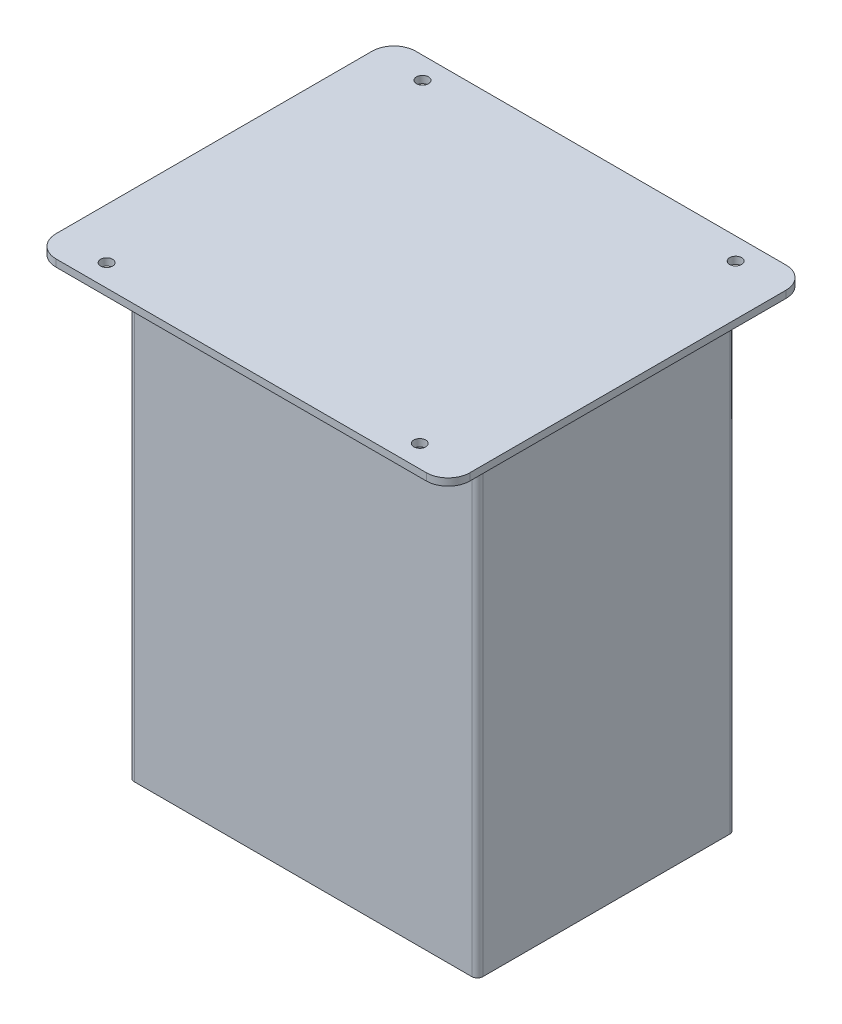
ISO-10303-21;
HEADER;
FILE_DESCRIPTION(('STEP AP214'),'2;1');
FILE_NAME('part.step','',(''),(''),'','','');
FILE_SCHEMA(('AUTOMOTIVE_DESIGN { 1 0 10303 214 1 1 1 1 }'));
ENDSEC;
DATA;
#1=APPLICATION_CONTEXT('core data for automotive mechanical design processes');
#2=APPLICATION_PROTOCOL_DEFINITION('international standard','automotive_design',2000,#1);
#3=PRODUCT_CONTEXT('',#1,'mechanical');
#4=PRODUCT('Part','Part','',(#3));
#5=PRODUCT_RELATED_PRODUCT_CATEGORY('part','',(#4));
#6=PRODUCT_DEFINITION_FORMATION('','',#4);
#7=PRODUCT_DEFINITION_CONTEXT('part definition',#1,'design');
#8=PRODUCT_DEFINITION('design','',#6,#7);
#9=PRODUCT_DEFINITION_SHAPE('','',#8);
#10=(LENGTH_UNIT() NAMED_UNIT(*) SI_UNIT(.MILLI.,.METRE.));
#11=(NAMED_UNIT(*) PLANE_ANGLE_UNIT() SI_UNIT($,.RADIAN.));
#12=(NAMED_UNIT(*) SI_UNIT($,.STERADIAN.) SOLID_ANGLE_UNIT());
#13=UNCERTAINTY_MEASURE_WITH_UNIT(LENGTH_MEASURE(1.E-05),#10,'distance_accuracy_value','');
#14=(GEOMETRIC_REPRESENTATION_CONTEXT(3) GLOBAL_UNCERTAINTY_ASSIGNED_CONTEXT((#13)) GLOBAL_UNIT_ASSIGNED_CONTEXT((#10,
#11,#12)) REPRESENTATION_CONTEXT('',''));
#15=CARTESIAN_POINT('',(0.,0.,0.));
#16=DIRECTION('',(0.,0.,1.));
#17=DIRECTION('',(1.,0.,0.));
#18=AXIS2_PLACEMENT_3D('',#15,#16,#17);
#19=CARTESIAN_POINT('',(94.9949,3.302,-82.55));
#20=DIRECTION('',(-1.,0.,0.));
#21=DIRECTION('',(0.,0.,-1.));
#22=AXIS2_PLACEMENT_3D('',#19,#20,#21);
#23=PLANE('',#22);
#24=DIRECTION('',(0.,0.,1.));
#25=VECTOR('',#24,1.);
#26=CARTESIAN_POINT('',(94.9949,0.,-82.55));
#27=LINE('',#26,#25);
#28=CARTESIAN_POINT('',(94.9949,0.,-72.55));
#29=VERTEX_POINT('',#28);
#30=CARTESIAN_POINT('',(94.9949,0.,72.55));
#31=VERTEX_POINT('',#30);
#32=EDGE_CURVE('E315',#29,#31,#27,.T.);
#33=ORIENTED_EDGE('',*,*,#32,.F.);
#34=DIRECTION('',(0.,-1.,0.));
#35=VECTOR('',#34,1.);
#36=CARTESIAN_POINT('',(94.9949,3.302,-72.55));
#37=LINE('',#36,#35);
#38=CARTESIAN_POINT('',(94.9949,3.302,-72.55));
#39=VERTEX_POINT('',#38);
#40=EDGE_CURVE('E367',#39,#29,#37,.T.);
#41=ORIENTED_EDGE('',*,*,#40,.F.);
#42=DIRECTION('',(0.,0.,1.));
#43=VECTOR('',#42,1.);
#44=CARTESIAN_POINT('',(94.9949,3.302,-82.55));
#45=LINE('',#44,#43);
#46=CARTESIAN_POINT('',(94.9949,3.302,72.55));
#47=VERTEX_POINT('',#46);
#48=EDGE_CURVE('E316',#39,#47,#45,.T.);
#49=ORIENTED_EDGE('',*,*,#48,.T.);
#50=DIRECTION('',(0.,-1.,0.));
#51=VECTOR('',#50,1.);
#52=CARTESIAN_POINT('',(94.9949,3.302,72.55));
#53=LINE('',#52,#51);
#54=EDGE_CURVE('E370',#31,#47,#53,.F.);
#55=ORIENTED_EDGE('',*,*,#54,.F.);
#56=EDGE_LOOP('',(#33,#41,#49,#55));
#57=FACE_BOUND('',#56,.T.);
#58=ADVANCED_FACE('F39',(#57),#23,.F.);
#59=CARTESIAN_POINT('',(-94.9949,3.302,82.55));
#60=DIRECTION('',(0.,0.,-1.));
#61=DIRECTION('',(1.,0.,0.));
#62=AXIS2_PLACEMENT_3D('',#59,#60,#61);
#63=PLANE('',#62);
#64=DIRECTION('',(-1.,0.,0.));
#65=VECTOR('',#64,1.);
#66=CARTESIAN_POINT('',(-94.9949,0.,82.55));
#67=LINE('',#66,#65);
#68=CARTESIAN_POINT('',(84.9949,0.,82.55));
#69=VERTEX_POINT('',#68);
#70=CARTESIAN_POINT('',(-84.9949,0.,82.55));
#71=VERTEX_POINT('',#70);
#72=EDGE_CURVE('E332',#69,#71,#67,.T.);
#73=ORIENTED_EDGE('',*,*,#72,.F.);
#74=DIRECTION('',(0.,-1.,0.));
#75=VECTOR('',#74,1.);
#76=CARTESIAN_POINT('',(84.9949000000001,3.302,82.55));
#77=LINE('',#76,#75);
#78=CARTESIAN_POINT('',(84.9949,3.302,82.55));
#79=VERTEX_POINT('',#78);
#80=EDGE_CURVE('E353',#79,#69,#77,.T.);
#81=ORIENTED_EDGE('',*,*,#80,.F.);
#82=DIRECTION('',(-1.,0.,0.));
#83=VECTOR('',#82,1.);
#84=CARTESIAN_POINT('',(-94.9949,3.302,82.55));
#85=LINE('',#84,#83);
#86=CARTESIAN_POINT('',(-84.9949,3.302,82.55));
#87=VERTEX_POINT('',#86);
#88=EDGE_CURVE('E319',#79,#87,#85,.T.);
#89=ORIENTED_EDGE('',*,*,#88,.T.);
#90=DIRECTION('',(0.,-1.,0.));
#91=VECTOR('',#90,1.);
#92=CARTESIAN_POINT('',(-84.9949,3.302,82.55));
#93=LINE('',#92,#91);
#94=EDGE_CURVE('E356',#71,#87,#93,.F.);
#95=ORIENTED_EDGE('',*,*,#94,.F.);
#96=EDGE_LOOP('',(#73,#81,#89,#95));
#97=FACE_BOUND('',#96,.T.);
#98=ADVANCED_FACE('F472',(#97),#63,.F.);
#99=CARTESIAN_POINT('',(-94.9949,3.302,-82.55));
#100=DIRECTION('',(1.,0.,0.));
#101=DIRECTION('',(0.,0.,1.));
#102=AXIS2_PLACEMENT_3D('',#99,#100,#101);
#103=PLANE('',#102);
#104=DIRECTION('',(0.,0.,-1.));
#105=VECTOR('',#104,1.);
#106=CARTESIAN_POINT('',(-94.9949,3.302,-82.55));
#107=LINE('',#106,#105);
#108=CARTESIAN_POINT('',(-94.9949,3.302,72.55));
#109=VERTEX_POINT('',#108);
#110=CARTESIAN_POINT('',(-94.9949,3.302,-72.55));
#111=VERTEX_POINT('',#110);
#112=EDGE_CURVE('E323',#109,#111,#107,.T.);
#113=ORIENTED_EDGE('',*,*,#112,.T.);
#114=DIRECTION('',(0.,-1.,0.));
#115=VECTOR('',#114,1.);
#116=CARTESIAN_POINT('',(-94.9949,3.302,-72.55));
#117=LINE('',#116,#115);
#118=CARTESIAN_POINT('',(-94.9949,0.,-72.55));
#119=VERTEX_POINT('',#118);
#120=EDGE_CURVE('E329',#119,#111,#117,.F.);
#121=ORIENTED_EDGE('',*,*,#120,.F.);
#122=DIRECTION('',(0.,0.,-1.));
#123=VECTOR('',#122,1.);
#124=CARTESIAN_POINT('',(-94.9949,0.,-82.55));
#125=LINE('',#124,#123);
#126=CARTESIAN_POINT('',(-94.9949,0.,72.55));
#127=VERTEX_POINT('',#126);
#128=EDGE_CURVE('E335',#127,#119,#125,.T.);
#129=ORIENTED_EDGE('',*,*,#128,.F.);
#130=DIRECTION('',(0.,-1.,0.));
#131=VECTOR('',#130,1.);
#132=CARTESIAN_POINT('',(-94.9949,3.302,72.55));
#133=LINE('',#132,#131);
#134=EDGE_CURVE('E342',#109,#127,#133,.T.);
#135=ORIENTED_EDGE('',*,*,#134,.F.);
#136=EDGE_LOOP('',(#113,#121,#129,#135));
#137=FACE_BOUND('',#136,.T.);
#138=ADVANCED_FACE('F478',(#137),#103,.F.);
#139=CARTESIAN_POINT('',(-94.9949,3.302,-82.55));
#140=DIRECTION('',(0.,0.,1.));
#141=DIRECTION('',(-1.,0.,0.));
#142=AXIS2_PLACEMENT_3D('',#139,#140,#141);
#143=PLANE('',#142);
#144=DIRECTION('',(1.,0.,0.));
#145=VECTOR('',#144,1.);
#146=CARTESIAN_POINT('',(-94.9949,0.,-82.55));
#147=LINE('',#146,#145);
#148=CARTESIAN_POINT('',(-84.9949,0.,-82.55));
#149=VERTEX_POINT('',#148);
#150=CARTESIAN_POINT('',(84.9949,0.,-82.55));
#151=VERTEX_POINT('',#150);
#152=EDGE_CURVE('E320',#149,#151,#147,.T.);
#153=ORIENTED_EDGE('',*,*,#152,.F.);
#154=DIRECTION('',(0.,-1.,0.));
#155=VECTOR('',#154,1.);
#156=CARTESIAN_POINT('',(-84.9949,3.302,-82.55));
#157=LINE('',#156,#155);
#158=CARTESIAN_POINT('',(-84.9949,3.302,-82.55));
#159=VERTEX_POINT('',#158);
#160=EDGE_CURVE('E373',#159,#149,#157,.T.);
#161=ORIENTED_EDGE('',*,*,#160,.F.);
#162=DIRECTION('',(1.,0.,0.));
#163=VECTOR('',#162,1.);
#164=CARTESIAN_POINT('',(-94.9949,3.302,-82.55));
#165=LINE('',#164,#163);
#166=CARTESIAN_POINT('',(84.9949,3.302,-82.55));
#167=VERTEX_POINT('',#166);
#168=EDGE_CURVE('E326',#159,#167,#165,.T.);
#169=ORIENTED_EDGE('',*,*,#168,.T.);
#170=DIRECTION('',(0.,-1.,0.));
#171=VECTOR('',#170,1.);
#172=CARTESIAN_POINT('',(84.9949000000001,3.302,-82.55));
#173=LINE('',#172,#171);
#174=EDGE_CURVE('E376',#151,#167,#173,.F.);
#175=ORIENTED_EDGE('',*,*,#174,.F.);
#176=EDGE_LOOP('',(#153,#161,#169,#175));
#177=FACE_BOUND('',#176,.T.);
#178=ADVANCED_FACE('F827',(#177),#143,.F.);
#179=CARTESIAN_POINT('',(0.,3.302,0.));
#180=DIRECTION('',(0.,-1.,0.));
#181=DIRECTION('',(0.,0.,1.));
#182=AXIS2_PLACEMENT_3D('',#179,#180,#181);
#183=PLANE('',#182);
#184=CARTESIAN_POINT('',(71.8681572309746,3.302,-72.5500000000002));
#185=DIRECTION('',(0.,-1.,0.));
#186=DIRECTION('',(0.,0.,-1.));
#187=AXIS2_PLACEMENT_3D('',#184,#185,#186);
#188=CIRCLE('',#187,2.74999999999999);
#189=CARTESIAN_POINT('',(71.8681572309746,3.302,-75.3000000000002));
#190=VERTEX_POINT('',#189);
#191=EDGE_CURVE('E291',#190,#190,#188,.T.);
#192=ORIENTED_EDGE('',*,*,#191,.T.);
#193=EDGE_LOOP('',(#192));
#194=FACE_BOUND('',#193,.T.);
#195=CARTESIAN_POINT('',(-71.8681572309744,3.302,-72.5500000000002));
#196=DIRECTION('',(0.,-1.,0.));
#197=DIRECTION('',(0.,0.,-1.));
#198=AXIS2_PLACEMENT_3D('',#195,#196,#197);
#199=CIRCLE('',#198,2.74999999999999);
#200=CARTESIAN_POINT('',(-71.8681572309744,3.302,-75.3000000000001));
#201=VERTEX_POINT('',#200);
#202=EDGE_CURVE('E297',#201,#201,#199,.T.);
#203=ORIENTED_EDGE('',*,*,#202,.T.);
#204=EDGE_LOOP('',(#203));
#205=FACE_BOUND('',#204,.T.);
#206=CARTESIAN_POINT('',(71.8681572309747,3.302,72.4296));
#207=DIRECTION('',(0.,-1.,0.));
#208=DIRECTION('',(0.,0.,-1.));
#209=AXIS2_PLACEMENT_3D('',#206,#207,#208);
#210=CIRCLE('',#209,2.74999999999999);
#211=CARTESIAN_POINT('',(71.8681572309747,3.302,69.6796));
#212=VERTEX_POINT('',#211);
#213=EDGE_CURVE('E303',#212,#212,#210,.T.);
#214=ORIENTED_EDGE('',*,*,#213,.T.);
#215=EDGE_LOOP('',(#214));
#216=FACE_BOUND('',#215,.T.);
#217=CARTESIAN_POINT('',(-71.8681572309743,3.302,72.4296000000001));
#218=DIRECTION('',(0.,-1.,0.));
#219=DIRECTION('',(0.,0.,-1.));
#220=AXIS2_PLACEMENT_3D('',#217,#218,#219);
#221=CIRCLE('',#220,2.74999999999999);
#222=CARTESIAN_POINT('',(-71.8681572309743,3.302,69.6796000000001));
#223=VERTEX_POINT('',#222);
#224=EDGE_CURVE('E309',#223,#223,#221,.T.);
#225=ORIENTED_EDGE('',*,*,#224,.T.);
#226=EDGE_LOOP('',(#225));
#227=FACE_BOUND('',#226,.T.);
#228=ORIENTED_EDGE('',*,*,#88,.F.);
#229=CARTESIAN_POINT('',(84.9949000000001,3.302,72.55));
#230=DIRECTION('',(0.,1.,0.));
#231=DIRECTION('',(0.,0.,1.));
#232=AXIS2_PLACEMENT_3D('',#229,#230,#231);
#233=CIRCLE('',#232,10.);
#234=EDGE_CURVE('E363',#47,#79,#233,.F.);
#235=ORIENTED_EDGE('',*,*,#234,.F.);
#236=ORIENTED_EDGE('',*,*,#48,.F.);
#237=CARTESIAN_POINT('',(84.9949,3.302,-72.55));
#238=DIRECTION('',(0.,1.,0.));
#239=DIRECTION('',(0.,0.,1.));
#240=AXIS2_PLACEMENT_3D('',#237,#238,#239);
#241=CIRCLE('',#240,10.);
#242=EDGE_CURVE('E361',#167,#39,#241,.F.);
#243=ORIENTED_EDGE('',*,*,#242,.F.);
#244=ORIENTED_EDGE('',*,*,#168,.F.);
#245=CARTESIAN_POINT('',(-84.9949,3.302,-72.55));
#246=DIRECTION('',(0.,1.,0.));
#247=DIRECTION('',(0.,0.,1.));
#248=AXIS2_PLACEMENT_3D('',#245,#246,#247);
#249=CIRCLE('',#248,10.);
#250=EDGE_CURVE('E359',#111,#159,#249,.F.);
#251=ORIENTED_EDGE('',*,*,#250,.F.);
#252=ORIENTED_EDGE('',*,*,#112,.F.);
#253=CARTESIAN_POINT('',(-84.9949,3.302,72.55));
#254=DIRECTION('',(0.,1.,0.));
#255=DIRECTION('',(0.,0.,1.));
#256=AXIS2_PLACEMENT_3D('',#253,#254,#255);
#257=CIRCLE('',#256,10.);
#258=EDGE_CURVE('E365',#87,#109,#257,.F.);
#259=ORIENTED_EDGE('',*,*,#258,.F.);
#260=EDGE_LOOP('',(#228,#235,#236,#243,#244,#251,#252,#259));
#261=FACE_BOUND('',#260,.T.);
#262=ADVANCED_FACE('F817',(#194,#205,#216,#227,#261),#183,.F.);
#263=CARTESIAN_POINT('',(0.,0.,0.));
#264=DIRECTION('',(0.,-1.,0.));
#265=DIRECTION('',(0.,0.,1.));
#266=AXIS2_PLACEMENT_3D('',#263,#264,#265);
#267=PLANE('',#266);
#268=DIRECTION('',(0.,0.,1.));
#269=VECTOR('',#268,1.);
#270=CARTESIAN_POINT('',(85.0051000000002,0.,0.));
#271=LINE('',#270,#269);
#272=CARTESIAN_POINT('',(85.0051000000001,0.,-56.71));
#273=VERTEX_POINT('',#272);
#274=CARTESIAN_POINT('',(85.0051000000002,0.,56.5978));
#275=VERTEX_POINT('',#274);
#276=EDGE_CURVE('E281',#273,#275,#271,.T.);
#277=ORIENTED_EDGE('',*,*,#276,.F.);
#278=CARTESIAN_POINT('',(82.4651000000001,0.,-56.71));
#279=DIRECTION('',(0.,1.,0.));
#280=DIRECTION('',(0.,0.,1.));
#281=AXIS2_PLACEMENT_3D('',#278,#279,#280);
#282=CIRCLE('',#281,2.54);
#283=CARTESIAN_POINT('',(82.4651000000001,0.,-59.25));
#284=VERTEX_POINT('',#283);
#285=EDGE_CURVE('E427',#284,#273,#282,.F.);
#286=ORIENTED_EDGE('',*,*,#285,.F.);
#287=DIRECTION('',(-1.,0.,0.));
#288=VECTOR('',#287,1.);
#289=CARTESIAN_POINT('',(0.,0.,-59.25));
#290=LINE('',#289,#288);
#291=CARTESIAN_POINT('',(77.4609000000002,0.,-59.25));
#292=VERTEX_POINT('',#291);
#293=EDGE_CURVE('E258',#284,#292,#290,.T.);
#294=ORIENTED_EDGE('',*,*,#293,.T.);
#295=CARTESIAN_POINT('',(77.4609000000002,0.,-56.71));
#296=DIRECTION('',(0.,1.,0.));
#297=DIRECTION('',(0.,0.,1.));
#298=AXIS2_PLACEMENT_3D('',#295,#296,#297);
#299=CIRCLE('',#298,2.54);
#300=CARTESIAN_POINT('',(74.9209000000002,0.,-56.71));
#301=VERTEX_POINT('',#300);
#302=EDGE_CURVE('E47',#301,#292,#299,.F.);
#303=ORIENTED_EDGE('',*,*,#302,.F.);
#304=DIRECTION('',(0.,0.,-1.));
#305=VECTOR('',#304,1.);
#306=CARTESIAN_POINT('',(74.9209000000002,0.,0.));
#307=LINE('',#306,#305);
#308=CARTESIAN_POINT('',(74.9209000000002,0.,49.09));
#309=VERTEX_POINT('',#308);
#310=EDGE_CURVE('E253',#309,#301,#307,.T.);
#311=ORIENTED_EDGE('',*,*,#310,.F.);
#312=DIRECTION('',(1.,0.,0.));
#313=VECTOR('',#312,1.);
#314=CARTESIAN_POINT('',(0.,0.,49.09));
#315=LINE('',#314,#313);
#316=CARTESIAN_POINT('',(-64.8450999999998,0.,49.09));
#317=VERTEX_POINT('',#316);
#318=EDGE_CURVE('E273',#317,#309,#315,.T.);
#319=ORIENTED_EDGE('',*,*,#318,.F.);
#320=DIRECTION('',(0.,0.,1.));
#321=VECTOR('',#320,1.);
#322=CARTESIAN_POINT('',(-64.8450999999998,0.,0.));
#323=LINE('',#322,#321);
#324=CARTESIAN_POINT('',(-64.8450999999998,0.,-56.71));
#325=VERTEX_POINT('',#324);
#326=EDGE_CURVE('E276',#325,#317,#323,.T.);
#327=ORIENTED_EDGE('',*,*,#326,.F.);
#328=CARTESIAN_POINT('',(-67.3850999999999,0.,-56.71));
#329=DIRECTION('',(0.,1.,0.));
#330=DIRECTION('',(0.,0.,1.));
#331=AXIS2_PLACEMENT_3D('',#328,#329,#330);
#332=CIRCLE('',#331,2.54);
#333=CARTESIAN_POINT('',(-67.3850999999999,0.,-59.25));
#334=VERTEX_POINT('',#333);
#335=EDGE_CURVE('E11',#334,#325,#332,.F.);
#336=ORIENTED_EDGE('',*,*,#335,.F.);
#337=CARTESIAN_POINT('',(-72.4650999999998,0.,-59.25));
#338=VERTEX_POINT('',#337);
#339=EDGE_CURVE('E278',#334,#338,#290,.T.);
#340=ORIENTED_EDGE('',*,*,#339,.T.);
#341=CARTESIAN_POINT('',(-72.4650999999998,0.,-56.71));
#342=DIRECTION('',(0.,1.,0.));
#343=DIRECTION('',(0.,0.,1.));
#344=AXIS2_PLACEMENT_3D('',#341,#342,#343);
#345=CIRCLE('',#344,2.54);
#346=CARTESIAN_POINT('',(-75.0050999999998,0.,-56.71));
#347=VERTEX_POINT('',#346);
#348=EDGE_CURVE('E424',#347,#338,#345,.F.);
#349=ORIENTED_EDGE('',*,*,#348,.F.);
#350=DIRECTION('',(0.,0.,1.));
#351=VECTOR('',#350,1.);
#352=CARTESIAN_POINT('',(-75.0050999999998,0.,0.));
#353=LINE('',#352,#351);
#354=CARTESIAN_POINT('',(-75.0050999999998,0.,56.5978));
#355=VERTEX_POINT('',#354);
#356=EDGE_CURVE('E282',#347,#355,#353,.T.);
#357=ORIENTED_EDGE('',*,*,#356,.T.);
#358=CARTESIAN_POINT('',(-72.4650999999998,0.,56.5978));
#359=DIRECTION('',(0.,1.,0.));
#360=DIRECTION('',(0.,0.,1.));
#361=AXIS2_PLACEMENT_3D('',#358,#359,#360);
#362=CIRCLE('',#361,2.54);
#363=CARTESIAN_POINT('',(-72.4650999999998,0.,59.1378));
#364=VERTEX_POINT('',#363);
#365=EDGE_CURVE('E421',#364,#355,#362,.F.);
#366=ORIENTED_EDGE('',*,*,#365,.F.);
#367=DIRECTION('',(-1.,0.,0.));
#368=VECTOR('',#367,1.);
#369=CARTESIAN_POINT('',(85.0051000000001,0.,59.1378));
#370=LINE('',#369,#368);
#371=CARTESIAN_POINT('',(82.4651000000002,0.,59.1378));
#372=VERTEX_POINT('',#371);
#373=EDGE_CURVE('E223',#372,#364,#370,.T.);
#374=ORIENTED_EDGE('',*,*,#373,.F.);
#375=CARTESIAN_POINT('',(82.4651000000002,0.,56.5978));
#376=DIRECTION('',(0.,1.,0.));
#377=DIRECTION('',(0.,0.,1.));
#378=AXIS2_PLACEMENT_3D('',#375,#376,#377);
#379=CIRCLE('',#378,2.54);
#380=EDGE_CURVE('E418',#275,#372,#379,.F.);
#381=ORIENTED_EDGE('',*,*,#380,.F.);
#382=EDGE_LOOP('',(#277,#286,#294,#303,#311,#319,#327,#336,#340,#349,#357,#366,#374,#381));
#383=FACE_BOUND('',#382,.T.);
#384=CARTESIAN_POINT('',(71.8681572309746,0.,-72.5500000000002));
#385=DIRECTION('',(0.,1.,0.));
#386=DIRECTION('',(0.,0.,1.));
#387=AXIS2_PLACEMENT_3D('',#384,#385,#386);
#388=CIRCLE('',#387,2.75);
#389=CARTESIAN_POINT('',(71.8681572309746,0.,-69.8000000000002));
#390=VERTEX_POINT('',#389);
#391=EDGE_CURVE('E294',#390,#390,#388,.T.);
#392=ORIENTED_EDGE('',*,*,#391,.T.);
#393=EDGE_LOOP('',(#392));
#394=FACE_BOUND('',#393,.T.);
#395=CARTESIAN_POINT('',(-71.8681572309744,0.,-72.5500000000002));
#396=DIRECTION('',(0.,1.,0.));
#397=DIRECTION('',(0.,0.,1.));
#398=AXIS2_PLACEMENT_3D('',#395,#396,#397);
#399=CIRCLE('',#398,2.75);
#400=CARTESIAN_POINT('',(-71.8681572309744,0.,-69.8000000000002));
#401=VERTEX_POINT('',#400);
#402=EDGE_CURVE('E300',#401,#401,#399,.T.);
#403=ORIENTED_EDGE('',*,*,#402,.T.);
#404=EDGE_LOOP('',(#403));
#405=FACE_BOUND('',#404,.T.);
#406=CARTESIAN_POINT('',(71.8681572309747,0.,72.4296));
#407=DIRECTION('',(0.,1.,0.));
#408=DIRECTION('',(0.,0.,1.));
#409=AXIS2_PLACEMENT_3D('',#406,#407,#408);
#410=CIRCLE('',#409,2.75);
#411=CARTESIAN_POINT('',(71.8681572309747,0.,75.1796));
#412=VERTEX_POINT('',#411);
#413=EDGE_CURVE('E306',#412,#412,#410,.T.);
#414=ORIENTED_EDGE('',*,*,#413,.T.);
#415=EDGE_LOOP('',(#414));
#416=FACE_BOUND('',#415,.T.);
#417=CARTESIAN_POINT('',(-71.8681572309743,0.,72.4296000000001));
#418=DIRECTION('',(0.,1.,0.));
#419=DIRECTION('',(0.,0.,1.));
#420=AXIS2_PLACEMENT_3D('',#417,#418,#419);
#421=CIRCLE('',#420,2.75);
#422=CARTESIAN_POINT('',(-71.8681572309743,0.,75.1796));
#423=VERTEX_POINT('',#422);
#424=EDGE_CURVE('E312',#423,#423,#421,.T.);
#425=ORIENTED_EDGE('',*,*,#424,.T.);
#426=EDGE_LOOP('',(#425));
#427=FACE_BOUND('',#426,.T.);
#428=ORIENTED_EDGE('',*,*,#128,.T.);
#429=CARTESIAN_POINT('',(-84.9949,0.,-72.55));
#430=DIRECTION('',(0.,1.,0.));
#431=DIRECTION('',(0.,0.,1.));
#432=AXIS2_PLACEMENT_3D('',#429,#430,#431);
#433=CIRCLE('',#432,10.);
#434=EDGE_CURVE('E345',#149,#119,#433,.T.);
#435=ORIENTED_EDGE('',*,*,#434,.F.);
#436=ORIENTED_EDGE('',*,*,#152,.T.);
#437=CARTESIAN_POINT('',(84.9949,0.,-72.55));
#438=DIRECTION('',(0.,1.,0.));
#439=DIRECTION('',(0.,0.,1.));
#440=AXIS2_PLACEMENT_3D('',#437,#438,#439);
#441=CIRCLE('',#440,10.);
#442=EDGE_CURVE('E347',#29,#151,#441,.T.);
#443=ORIENTED_EDGE('',*,*,#442,.F.);
#444=ORIENTED_EDGE('',*,*,#32,.T.);
#445=CARTESIAN_POINT('',(84.9949000000001,0.,72.55));
#446=DIRECTION('',(0.,1.,0.));
#447=DIRECTION('',(0.,0.,1.));
#448=AXIS2_PLACEMENT_3D('',#445,#446,#447);
#449=CIRCLE('',#448,10.);
#450=EDGE_CURVE('E349',#69,#31,#449,.T.);
#451=ORIENTED_EDGE('',*,*,#450,.F.);
#452=ORIENTED_EDGE('',*,*,#72,.T.);
#453=CARTESIAN_POINT('',(-84.9949,0.,72.55));
#454=DIRECTION('',(0.,1.,0.));
#455=DIRECTION('',(0.,0.,1.));
#456=AXIS2_PLACEMENT_3D('',#453,#454,#455);
#457=CIRCLE('',#456,10.);
#458=EDGE_CURVE('E351',#127,#71,#457,.T.);
#459=ORIENTED_EDGE('',*,*,#458,.F.);
#460=EDGE_LOOP('',(#428,#435,#436,#443,#444,#451,#452,#459));
#461=FACE_BOUND('',#460,.T.);
#462=ADVANCED_FACE('F437',(#383,#394,#405,#416,#427,#461),#267,.T.);
#463=CARTESIAN_POINT('',(-71.8681572309743,3.302,72.4296000000001));
#464=DIRECTION('',(0.,1.,0.));
#465=DIRECTION('',(0.,0.,-1.));
#466=AXIS2_PLACEMENT_3D('',#463,#464,#465);
#467=CYLINDRICAL_SURFACE('',#466,2.75);
#468=ORIENTED_EDGE('',*,*,#224,.F.);
#469=EDGE_LOOP('',(#468));
#470=FACE_BOUND('',#469,.T.);
#471=ORIENTED_EDGE('',*,*,#424,.F.);
#472=EDGE_LOOP('',(#471));
#473=FACE_BOUND('',#472,.T.);
#474=ADVANCED_FACE('F798',(#470,#473),#467,.F.);
#475=CARTESIAN_POINT('',(71.8681572309747,3.302,72.4296));
#476=DIRECTION('',(0.,1.,0.));
#477=DIRECTION('',(0.,0.,-1.));
#478=AXIS2_PLACEMENT_3D('',#475,#476,#477);
#479=CYLINDRICAL_SURFACE('',#478,2.75);
#480=ORIENTED_EDGE('',*,*,#213,.F.);
#481=EDGE_LOOP('',(#480));
#482=FACE_BOUND('',#481,.T.);
#483=ORIENTED_EDGE('',*,*,#413,.F.);
#484=EDGE_LOOP('',(#483));
#485=FACE_BOUND('',#484,.T.);
#486=ADVANCED_FACE('F788',(#482,#485),#479,.F.);
#487=CARTESIAN_POINT('',(-71.8681572309744,3.302,-72.5500000000002));
#488=DIRECTION('',(0.,1.,0.));
#489=DIRECTION('',(0.,0.,-1.));
#490=AXIS2_PLACEMENT_3D('',#487,#488,#489);
#491=CYLINDRICAL_SURFACE('',#490,2.75);
#492=ORIENTED_EDGE('',*,*,#202,.F.);
#493=EDGE_LOOP('',(#492));
#494=FACE_BOUND('',#493,.T.);
#495=ORIENTED_EDGE('',*,*,#402,.F.);
#496=EDGE_LOOP('',(#495));
#497=FACE_BOUND('',#496,.T.);
#498=ADVANCED_FACE('F778',(#494,#497),#491,.F.);
#499=CARTESIAN_POINT('',(71.8681572309746,3.302,-72.5500000000002));
#500=DIRECTION('',(0.,1.,0.));
#501=DIRECTION('',(0.,0.,-1.));
#502=AXIS2_PLACEMENT_3D('',#499,#500,#501);
#503=CYLINDRICAL_SURFACE('',#502,2.75);
#504=ORIENTED_EDGE('',*,*,#191,.F.);
#505=EDGE_LOOP('',(#504));
#506=FACE_BOUND('',#505,.T.);
#507=ORIENTED_EDGE('',*,*,#391,.F.);
#508=EDGE_LOOP('',(#507));
#509=FACE_BOUND('',#508,.T.);
#510=ADVANCED_FACE('F488',(#506,#509),#503,.F.);
#511=CARTESIAN_POINT('',(-84.9949,3.302,72.55));
#512=DIRECTION('',(0.,-1.,0.));
#513=DIRECTION('',(0.,0.,1.));
#514=AXIS2_PLACEMENT_3D('',#511,#512,#513);
#515=CYLINDRICAL_SURFACE('',#514,10.);
#516=ORIENTED_EDGE('',*,*,#258,.T.);
#517=ORIENTED_EDGE('',*,*,#134,.T.);
#518=ORIENTED_EDGE('',*,*,#458,.T.);
#519=ORIENTED_EDGE('',*,*,#94,.T.);
#520=EDGE_LOOP('',(#516,#517,#518,#519));
#521=FACE_BOUND('',#520,.T.);
#522=ADVANCED_FACE('F484',(#521),#515,.T.);
#523=CARTESIAN_POINT('',(84.9949000000001,3.302,72.55));
#524=DIRECTION('',(0.,-1.,0.));
#525=DIRECTION('',(0.,0.,1.));
#526=AXIS2_PLACEMENT_3D('',#523,#524,#525);
#527=CYLINDRICAL_SURFACE('',#526,10.);
#528=ORIENTED_EDGE('',*,*,#234,.T.);
#529=ORIENTED_EDGE('',*,*,#80,.T.);
#530=ORIENTED_EDGE('',*,*,#450,.T.);
#531=ORIENTED_EDGE('',*,*,#54,.T.);
#532=EDGE_LOOP('',(#528,#529,#530,#531));
#533=FACE_BOUND('',#532,.T.);
#534=ADVANCED_FACE('F487',(#533),#527,.T.);
#535=CARTESIAN_POINT('',(84.9949,3.302,-72.55));
#536=DIRECTION('',(0.,-1.,0.));
#537=DIRECTION('',(0.,0.,1.));
#538=AXIS2_PLACEMENT_3D('',#535,#536,#537);
#539=CYLINDRICAL_SURFACE('',#538,10.);
#540=ORIENTED_EDGE('',*,*,#242,.T.);
#541=ORIENTED_EDGE('',*,*,#40,.T.);
#542=ORIENTED_EDGE('',*,*,#442,.T.);
#543=ORIENTED_EDGE('',*,*,#174,.T.);
#544=EDGE_LOOP('',(#540,#541,#542,#543));
#545=FACE_BOUND('',#544,.T.);
#546=ADVANCED_FACE('F492',(#545),#539,.T.);
#547=CARTESIAN_POINT('',(-84.9949,3.302,-72.55));
#548=DIRECTION('',(0.,-1.,0.));
#549=DIRECTION('',(0.,0.,1.));
#550=AXIS2_PLACEMENT_3D('',#547,#548,#549);
#551=CYLINDRICAL_SURFACE('',#550,10.);
#552=ORIENTED_EDGE('',*,*,#250,.T.);
#553=ORIENTED_EDGE('',*,*,#160,.T.);
#554=ORIENTED_EDGE('',*,*,#434,.T.);
#555=ORIENTED_EDGE('',*,*,#120,.T.);
#556=EDGE_LOOP('',(#552,#553,#554,#555));
#557=FACE_BOUND('',#556,.T.);
#558=ADVANCED_FACE('F496',(#557),#551,.T.);
#559=CARTESIAN_POINT('',(74.9209000000002,-210.,0.));
#560=DIRECTION('',(-1.,0.,0.));
#561=DIRECTION('',(0.,0.,-1.));
#562=AXIS2_PLACEMENT_3D('',#559,#560,#561);
#563=PLANE('',#562);
#564=DIRECTION('',(0.,0.,-1.));
#565=VECTOR('',#564,1.);
#566=CARTESIAN_POINT('',(74.9209000000002,-210.,0.));
#567=LINE('',#566,#565);
#568=CARTESIAN_POINT('',(74.9209000000002,-210.,49.09));
#569=VERTEX_POINT('',#568);
#570=CARTESIAN_POINT('',(74.9209000000002,-210.,-56.71));
#571=VERTEX_POINT('',#570);
#572=EDGE_CURVE('E254',#569,#571,#567,.T.);
#573=ORIENTED_EDGE('',*,*,#572,.F.);
#574=DIRECTION('',(0.,1.,0.));
#575=VECTOR('',#574,1.);
#576=CARTESIAN_POINT('',(74.9209000000002,-210.,49.09));
#577=LINE('',#576,#575);
#578=EDGE_CURVE('E289',#569,#309,#577,.T.);
#579=ORIENTED_EDGE('',*,*,#578,.T.);
#580=ORIENTED_EDGE('',*,*,#310,.T.);
#581=DIRECTION('',(0.,1.,0.));
#582=VECTOR('',#581,1.);
#583=CARTESIAN_POINT('',(74.9209000000002,0.,-56.71));
#584=LINE('',#583,#582);
#585=EDGE_CURVE('E61',#571,#301,#584,.T.);
#586=ORIENTED_EDGE('',*,*,#585,.F.);
#587=EDGE_LOOP('',(#573,#579,#580,#586));
#588=FACE_BOUND('',#587,.T.);
#589=ADVANCED_FACE('F449',(#588),#563,.T.);
#590=CARTESIAN_POINT('',(0.,-210.,49.09));
#591=DIRECTION('',(0.,0.,-1.));
#592=DIRECTION('',(1.,0.,0.));
#593=AXIS2_PLACEMENT_3D('',#590,#591,#592);
#594=PLANE('',#593);
#595=ORIENTED_EDGE('',*,*,#318,.T.);
#596=ORIENTED_EDGE('',*,*,#578,.F.);
#597=DIRECTION('',(1.,0.,0.));
#598=VECTOR('',#597,1.);
#599=CARTESIAN_POINT('',(0.,-210.,49.09));
#600=LINE('',#599,#598);
#601=CARTESIAN_POINT('',(-64.8450999999998,-210.,49.09));
#602=VERTEX_POINT('',#601);
#603=EDGE_CURVE('E257',#602,#569,#600,.T.);
#604=ORIENTED_EDGE('',*,*,#603,.F.);
#605=DIRECTION('',(0.,1.,0.));
#606=VECTOR('',#605,1.);
#607=CARTESIAN_POINT('',(-64.8450999999998,-210.,49.09));
#608=LINE('',#607,#606);
#609=EDGE_CURVE('E287',#602,#317,#608,.T.);
#610=ORIENTED_EDGE('',*,*,#609,.T.);
#611=EDGE_LOOP('',(#595,#596,#604,#610));
#612=FACE_BOUND('',#611,.T.);
#613=ADVANCED_FACE('F455',(#612),#594,.T.);
#614=CARTESIAN_POINT('',(-64.8450999999998,-210.,0.));
#615=DIRECTION('',(1.,0.,0.));
#616=DIRECTION('',(0.,0.,1.));
#617=AXIS2_PLACEMENT_3D('',#614,#615,#616);
#618=PLANE('',#617);
#619=ORIENTED_EDGE('',*,*,#326,.T.);
#620=ORIENTED_EDGE('',*,*,#609,.F.);
#621=DIRECTION('',(0.,0.,1.));
#622=VECTOR('',#621,1.);
#623=CARTESIAN_POINT('',(-64.8450999999998,-210.,0.));
#624=LINE('',#623,#622);
#625=CARTESIAN_POINT('',(-64.8450999999998,-210.,-56.71));
#626=VERTEX_POINT('',#625);
#627=EDGE_CURVE('E260',#626,#602,#624,.T.);
#628=ORIENTED_EDGE('',*,*,#627,.F.);
#629=DIRECTION('',(0.,1.,0.));
#630=VECTOR('',#629,1.);
#631=CARTESIAN_POINT('',(-64.8450999999998,-210.,-56.71));
#632=LINE('',#631,#630);
#633=EDGE_CURVE('E54',#325,#626,#632,.F.);
#634=ORIENTED_EDGE('',*,*,#633,.F.);
#635=EDGE_LOOP('',(#619,#620,#628,#634));
#636=FACE_BOUND('',#635,.T.);
#637=ADVANCED_FACE('F458',(#636),#618,.T.);
#638=CARTESIAN_POINT('',(0.,-210.,-59.25));
#639=DIRECTION('',(0.,0.,1.));
#640=DIRECTION('',(-1.,0.,0.));
#641=AXIS2_PLACEMENT_3D('',#638,#639,#640);
#642=PLANE('',#641);
#643=ORIENTED_EDGE('',*,*,#339,.F.);
#644=DIRECTION('',(0.,1.,0.));
#645=VECTOR('',#644,1.);
#646=CARTESIAN_POINT('',(-67.3850999999999,0.,-59.25));
#647=LINE('',#646,#645);
#648=CARTESIAN_POINT('',(-67.3850999999999,-210.,-59.25));
#649=VERTEX_POINT('',#648);
#650=EDGE_CURVE('E406',#649,#334,#647,.T.);
#651=ORIENTED_EDGE('',*,*,#650,.F.);
#652=DIRECTION('',(-1.,0.,0.));
#653=VECTOR('',#652,1.);
#654=CARTESIAN_POINT('',(0.,-210.,-59.25));
#655=LINE('',#654,#653);
#656=CARTESIAN_POINT('',(-72.4650999999998,-210.,-59.25));
#657=VERTEX_POINT('',#656);
#658=EDGE_CURVE('E262',#649,#657,#655,.T.);
#659=ORIENTED_EDGE('',*,*,#658,.T.);
#660=DIRECTION('',(0.,1.,0.));
#661=VECTOR('',#660,1.);
#662=CARTESIAN_POINT('',(-72.4650999999998,-210.,-59.25));
#663=LINE('',#662,#661);
#664=EDGE_CURVE('E408',#338,#657,#663,.F.);
#665=ORIENTED_EDGE('',*,*,#664,.F.);
#666=EDGE_LOOP('',(#643,#651,#659,#665));
#667=FACE_BOUND('',#666,.T.);
#668=ADVANCED_FACE('F460',(#667),#642,.F.);
#669=CARTESIAN_POINT('',(-75.0050999999998,-210.,0.));
#670=DIRECTION('',(1.,0.,0.));
#671=DIRECTION('',(0.,0.,1.));
#672=AXIS2_PLACEMENT_3D('',#669,#670,#671);
#673=PLANE('',#672);
#674=ORIENTED_EDGE('',*,*,#356,.F.);
#675=DIRECTION('',(0.,1.,0.));
#676=VECTOR('',#675,1.);
#677=CARTESIAN_POINT('',(-75.0050999999998,-210.,-56.71));
#678=LINE('',#677,#676);
#679=CARTESIAN_POINT('',(-75.0050999999998,-210.,-56.71));
#680=VERTEX_POINT('',#679);
#681=EDGE_CURVE('E401',#680,#347,#678,.T.);
#682=ORIENTED_EDGE('',*,*,#681,.F.);
#683=DIRECTION('',(0.,0.,1.));
#684=VECTOR('',#683,1.);
#685=CARTESIAN_POINT('',(-75.0050999999998,-210.,0.));
#686=LINE('',#685,#684);
#687=CARTESIAN_POINT('',(-75.0050999999998,-210.,56.5978));
#688=VERTEX_POINT('',#687);
#689=EDGE_CURVE('E265',#680,#688,#686,.T.);
#690=ORIENTED_EDGE('',*,*,#689,.T.);
#691=DIRECTION('',(0.,-1.,0.));
#692=VECTOR('',#691,1.);
#693=CARTESIAN_POINT('',(-75.0050999999998,-210.,56.5978));
#694=LINE('',#693,#692);
#695=EDGE_CURVE('E403',#355,#688,#694,.T.);
#696=ORIENTED_EDGE('',*,*,#695,.F.);
#697=EDGE_LOOP('',(#674,#682,#690,#696));
#698=FACE_BOUND('',#697,.T.);
#699=ADVANCED_FACE('F466',(#698),#673,.F.);
#700=CARTESIAN_POINT('',(85.0051000000002,-210.,0.));
#701=DIRECTION('',(1.,0.,0.));
#702=DIRECTION('',(0.,0.,1.));
#703=AXIS2_PLACEMENT_3D('',#700,#701,#702);
#704=PLANE('',#703);
#705=DIRECTION('',(0.,0.,1.));
#706=VECTOR('',#705,1.);
#707=CARTESIAN_POINT('',(85.0051000000002,-210.,0.));
#708=LINE('',#707,#706);
#709=CARTESIAN_POINT('',(85.0051000000001,-210.,-56.71));
#710=VERTEX_POINT('',#709);
#711=CARTESIAN_POINT('',(85.0051000000002,-210.,56.5978));
#712=VERTEX_POINT('',#711);
#713=EDGE_CURVE('E269',#710,#712,#708,.T.);
#714=ORIENTED_EDGE('',*,*,#713,.F.);
#715=DIRECTION('',(0.,1.,0.));
#716=VECTOR('',#715,1.);
#717=CARTESIAN_POINT('',(85.0051000000001,-210.,-56.71));
#718=LINE('',#717,#716);
#719=EDGE_CURVE('E396',#273,#710,#718,.F.);
#720=ORIENTED_EDGE('',*,*,#719,.F.);
#721=ORIENTED_EDGE('',*,*,#276,.T.);
#722=DIRECTION('',(0.,-1.,0.));
#723=VECTOR('',#722,1.);
#724=CARTESIAN_POINT('',(85.0051000000002,-210.,56.5978));
#725=LINE('',#724,#723);
#726=EDGE_CURVE('E399',#712,#275,#725,.F.);
#727=ORIENTED_EDGE('',*,*,#726,.F.);
#728=EDGE_LOOP('',(#714,#720,#721,#727));
#729=FACE_BOUND('',#728,.T.);
#730=ADVANCED_FACE('F545',(#729),#704,.T.);
#731=CARTESIAN_POINT('',(82.4651000000001,-210.,-59.25));
#732=VERTEX_POINT('',#731);
#733=CARTESIAN_POINT('',(77.4609000000002,-210.,-59.25));
#734=VERTEX_POINT('',#733);
#735=EDGE_CURVE('E266',#732,#734,#655,.T.);
#736=ORIENTED_EDGE('',*,*,#735,.T.);
#737=DIRECTION('',(0.,1.,0.));
#738=VECTOR('',#737,1.);
#739=CARTESIAN_POINT('',(77.4609000000002,-210.,-59.25));
#740=LINE('',#739,#738);
#741=EDGE_CURVE('E411',#292,#734,#740,.F.);
#742=ORIENTED_EDGE('',*,*,#741,.F.);
#743=ORIENTED_EDGE('',*,*,#293,.F.);
#744=DIRECTION('',(0.,1.,0.));
#745=VECTOR('',#744,1.);
#746=CARTESIAN_POINT('',(82.4651000000001,0.,-59.25));
#747=LINE('',#746,#745);
#748=EDGE_CURVE('E414',#732,#284,#747,.T.);
#749=ORIENTED_EDGE('',*,*,#748,.F.);
#750=EDGE_LOOP('',(#736,#742,#743,#749));
#751=FACE_BOUND('',#750,.T.);
#752=ADVANCED_FACE('F441',(#751),#642,.F.);
#753=CARTESIAN_POINT('',(0.,-210.,0.));
#754=DIRECTION('',(0.,-1.,0.));
#755=DIRECTION('',(0.,0.,1.));
#756=AXIS2_PLACEMENT_3D('',#753,#754,#755);
#757=PLANE('',#756);
#758=DIRECTION('',(1.,0.,0.));
#759=VECTOR('',#758,1.);
#760=CARTESIAN_POINT('',(85.0051000000001,-210.,59.1378));
#761=LINE('',#760,#759);
#762=CARTESIAN_POINT('',(-72.4650999999998,-210.,59.1378));
#763=VERTEX_POINT('',#762);
#764=CARTESIAN_POINT('',(82.4651000000002,-210.,59.1378));
#765=VERTEX_POINT('',#764);
#766=EDGE_CURVE('E538',#763,#765,#761,.T.);
#767=ORIENTED_EDGE('',*,*,#766,.F.);
#768=CARTESIAN_POINT('',(-72.4650999999998,-210.,56.5978));
#769=DIRECTION('',(0.,1.,0.));
#770=DIRECTION('',(0.,0.,1.));
#771=AXIS2_PLACEMENT_3D('',#768,#769,#770);
#772=CIRCLE('',#771,2.54);
#773=EDGE_CURVE('E391',#688,#763,#772,.T.);
#774=ORIENTED_EDGE('',*,*,#773,.F.);
#775=ORIENTED_EDGE('',*,*,#689,.F.);
#776=CARTESIAN_POINT('',(-72.4650999999998,-210.,-56.71));
#777=DIRECTION('',(0.,1.,0.));
#778=DIRECTION('',(0.,0.,1.));
#779=AXIS2_PLACEMENT_3D('',#776,#777,#778);
#780=CIRCLE('',#779,2.54);
#781=EDGE_CURVE('E389',#657,#680,#780,.T.);
#782=ORIENTED_EDGE('',*,*,#781,.F.);
#783=ORIENTED_EDGE('',*,*,#658,.F.);
#784=CARTESIAN_POINT('',(-67.3850999999999,-210.,-56.71));
#785=DIRECTION('',(0.,1.,0.));
#786=DIRECTION('',(0.,0.,1.));
#787=AXIS2_PLACEMENT_3D('',#784,#785,#786);
#788=CIRCLE('',#787,2.54);
#789=EDGE_CURVE('E383',#626,#649,#788,.T.);
#790=ORIENTED_EDGE('',*,*,#789,.F.);
#791=ORIENTED_EDGE('',*,*,#627,.T.);
#792=ORIENTED_EDGE('',*,*,#603,.T.);
#793=ORIENTED_EDGE('',*,*,#572,.T.);
#794=CARTESIAN_POINT('',(77.4609000000002,-210.,-56.71));
#795=DIRECTION('',(0.,1.,0.));
#796=DIRECTION('',(0.,0.,1.));
#797=AXIS2_PLACEMENT_3D('',#794,#795,#796);
#798=CIRCLE('',#797,2.54);
#799=EDGE_CURVE('E385',#734,#571,#798,.T.);
#800=ORIENTED_EDGE('',*,*,#799,.F.);
#801=ORIENTED_EDGE('',*,*,#735,.F.);
#802=CARTESIAN_POINT('',(82.4651000000001,-210.,-56.71));
#803=DIRECTION('',(0.,1.,0.));
#804=DIRECTION('',(0.,0.,1.));
#805=AXIS2_PLACEMENT_3D('',#802,#803,#804);
#806=CIRCLE('',#805,2.54);
#807=EDGE_CURVE('E387',#710,#732,#806,.T.);
#808=ORIENTED_EDGE('',*,*,#807,.F.);
#809=ORIENTED_EDGE('',*,*,#713,.T.);
#810=CARTESIAN_POINT('',(82.4651000000002,-210.,56.5978));
#811=DIRECTION('',(0.,1.,0.));
#812=DIRECTION('',(0.,0.,1.));
#813=AXIS2_PLACEMENT_3D('',#810,#811,#812);
#814=CIRCLE('',#813,2.54);
#815=EDGE_CURVE('E394',#765,#712,#814,.T.);
#816=ORIENTED_EDGE('',*,*,#815,.F.);
#817=EDGE_LOOP('',(#767,#774,#775,#782,#783,#790,#791,#792,#793,#800,#801,#808,#809,#816));
#818=FACE_BOUND('',#817,.T.);
#819=CARTESIAN_POINT('',(-69.9250999999998,-210.,-21.15));
#820=DIRECTION('',(0.,1.,0.));
#821=DIRECTION('',(0.,0.,1.));
#822=AXIS2_PLACEMENT_3D('',#819,#820,#821);
#823=CIRCLE('',#822,1.58749999999999);
#824=CARTESIAN_POINT('',(-69.9250999999998,-210.,-19.5625));
#825=VERTEX_POINT('',#824);
#826=EDGE_CURVE('E217',#825,#825,#823,.T.);
#827=ORIENTED_EDGE('',*,*,#826,.T.);
#828=EDGE_LOOP('',(#827));
#829=FACE_BOUND('',#828,.T.);
#830=CARTESIAN_POINT('',(-69.9250999999998,-210.,21.15));
#831=DIRECTION('',(0.,1.,0.));
#832=DIRECTION('',(0.,0.,1.));
#833=AXIS2_PLACEMENT_3D('',#830,#831,#832);
#834=CIRCLE('',#833,1.58749999999999);
#835=CARTESIAN_POINT('',(-69.9250999999998,-210.,22.7375));
#836=VERTEX_POINT('',#835);
#837=EDGE_CURVE('E216',#836,#836,#834,.T.);
#838=ORIENTED_EDGE('',*,*,#837,.T.);
#839=EDGE_LOOP('',(#838));
#840=FACE_BOUND('',#839,.T.);
#841=CARTESIAN_POINT('',(-36.9050999999998,-210.,54.17));
#842=DIRECTION('',(0.,1.,0.));
#843=DIRECTION('',(0.,0.,1.));
#844=AXIS2_PLACEMENT_3D('',#841,#842,#843);
#845=CIRCLE('',#844,1.58749999999999);
#846=CARTESIAN_POINT('',(-36.9050999999998,-210.,55.7575));
#847=VERTEX_POINT('',#846);
#848=EDGE_CURVE('E229',#847,#847,#845,.T.);
#849=ORIENTED_EDGE('',*,*,#848,.T.);
#850=EDGE_LOOP('',(#849));
#851=FACE_BOUND('',#850,.T.);
#852=CARTESIAN_POINT('',(56.8949,-210.,54.17));
#853=DIRECTION('',(0.,1.,0.));
#854=DIRECTION('',(0.,0.,1.));
#855=AXIS2_PLACEMENT_3D('',#852,#853,#854);
#856=CIRCLE('',#855,1.58749999999999);
#857=CARTESIAN_POINT('',(56.8949,-210.,55.7575));
#858=VERTEX_POINT('',#857);
#859=EDGE_CURVE('E235',#858,#858,#856,.T.);
#860=ORIENTED_EDGE('',*,*,#859,.T.);
#861=EDGE_LOOP('',(#860));
#862=FACE_BOUND('',#861,.T.);
#863=CARTESIAN_POINT('',(79.9630000000002,-210.,21.15));
#864=DIRECTION('',(0.,1.,0.));
#865=DIRECTION('',(0.,0.,1.));
#866=AXIS2_PLACEMENT_3D('',#863,#864,#865);
#867=CIRCLE('',#866,1.58749999999999);
#868=CARTESIAN_POINT('',(79.9630000000002,-210.,22.7375));
#869=VERTEX_POINT('',#868);
#870=EDGE_CURVE('E241',#869,#869,#867,.T.);
#871=ORIENTED_EDGE('',*,*,#870,.T.);
#872=EDGE_LOOP('',(#871));
#873=FACE_BOUND('',#872,.T.);
#874=CARTESIAN_POINT('',(79.9630000000002,-210.,-21.15));
#875=DIRECTION('',(0.,1.,0.));
#876=DIRECTION('',(0.,0.,1.));
#877=AXIS2_PLACEMENT_3D('',#874,#875,#876);
#878=CIRCLE('',#877,1.58749999999999);
#879=CARTESIAN_POINT('',(79.9630000000002,-210.,-19.5625));
#880=VERTEX_POINT('',#879);
#881=EDGE_CURVE('E247',#880,#880,#878,.T.);
#882=ORIENTED_EDGE('',*,*,#881,.T.);
#883=EDGE_LOOP('',(#882));
#884=FACE_BOUND('',#883,.T.);
#885=ADVANCED_FACE('F445',(#818,#829,#840,#851,#862,#873,#884),#757,.T.);
#886=CARTESIAN_POINT('',(79.9630000000002,-184.6,-21.15));
#887=DIRECTION('',(0.,-1.,0.));
#888=DIRECTION('',(0.,0.,1.));
#889=AXIS2_PLACEMENT_3D('',#886,#887,#888);
#890=CONICAL_SURFACE('',#889,1.58749999999999,1.02974425867666);
#891=CARTESIAN_POINT('',(79.9630000000002,-183.646133767294,-21.15));
#892=VERTEX_POINT('',#891);
#893=VERTEX_LOOP('',#892);
#894=FACE_BOUND('',#893,.T.);
#895=CARTESIAN_POINT('',(79.9630000000002,-184.6,-21.15));
#896=DIRECTION('',(0.,1.,0.));
#897=DIRECTION('',(0.,0.,1.));
#898=AXIS2_PLACEMENT_3D('',#895,#896,#897);
#899=CIRCLE('',#898,1.58749999999999);
#900=CARTESIAN_POINT('',(79.9630000000002,-184.6,-19.5625));
#901=VERTEX_POINT('',#900);
#902=EDGE_CURVE('E250',#901,#901,#899,.T.);
#903=ORIENTED_EDGE('',*,*,#902,.F.);
#904=EDGE_LOOP('',(#903));
#905=FACE_BOUND('',#904,.T.);
#906=ADVANCED_FACE('F555',(#894,#905),#890,.F.);
#907=CARTESIAN_POINT('',(79.9630000000002,-210.,-21.15));
#908=DIRECTION('',(0.,-1.,0.));
#909=DIRECTION('',(0.,0.,1.));
#910=AXIS2_PLACEMENT_3D('',#907,#908,#909);
#911=CYLINDRICAL_SURFACE('',#910,1.58749999999999);
#912=ORIENTED_EDGE('',*,*,#902,.T.);
#913=EDGE_LOOP('',(#912));
#914=FACE_BOUND('',#913,.T.);
#915=ORIENTED_EDGE('',*,*,#881,.F.);
#916=EDGE_LOOP('',(#915));
#917=FACE_BOUND('',#916,.T.);
#918=ADVANCED_FACE('F558',(#914,#917),#911,.F.);
#919=CARTESIAN_POINT('',(79.9630000000002,-184.6,21.15));
#920=DIRECTION('',(0.,-1.,0.));
#921=DIRECTION('',(0.,0.,1.));
#922=AXIS2_PLACEMENT_3D('',#919,#920,#921);
#923=CONICAL_SURFACE('',#922,1.58749999999999,1.02974425867666);
#924=CARTESIAN_POINT('',(79.9630000000002,-183.646133767294,21.15));
#925=VERTEX_POINT('',#924);
#926=VERTEX_LOOP('',#925);
#927=FACE_BOUND('',#926,.T.);
#928=CARTESIAN_POINT('',(79.9630000000002,-184.6,21.15));
#929=DIRECTION('',(0.,1.,0.));
#930=DIRECTION('',(0.,0.,1.));
#931=AXIS2_PLACEMENT_3D('',#928,#929,#930);
#932=CIRCLE('',#931,1.58749999999999);
#933=CARTESIAN_POINT('',(79.9630000000002,-184.6,22.7375));
#934=VERTEX_POINT('',#933);
#935=EDGE_CURVE('E244',#934,#934,#932,.T.);
#936=ORIENTED_EDGE('',*,*,#935,.F.);
#937=EDGE_LOOP('',(#936));
#938=FACE_BOUND('',#937,.T.);
#939=ADVANCED_FACE('F562',(#927,#938),#923,.F.);
#940=CARTESIAN_POINT('',(79.9630000000002,-210.,21.15));
#941=DIRECTION('',(0.,-1.,0.));
#942=DIRECTION('',(0.,0.,1.));
#943=AXIS2_PLACEMENT_3D('',#940,#941,#942);
#944=CYLINDRICAL_SURFACE('',#943,1.58749999999999);
#945=ORIENTED_EDGE('',*,*,#935,.T.);
#946=EDGE_LOOP('',(#945));
#947=FACE_BOUND('',#946,.T.);
#948=ORIENTED_EDGE('',*,*,#870,.F.);
#949=EDGE_LOOP('',(#948));
#950=FACE_BOUND('',#949,.T.);
#951=ADVANCED_FACE('F566',(#947,#950),#944,.F.);
#952=CARTESIAN_POINT('',(56.8949,-184.6,54.17));
#953=DIRECTION('',(0.,-1.,0.));
#954=DIRECTION('',(0.,0.,1.));
#955=AXIS2_PLACEMENT_3D('',#952,#953,#954);
#956=CONICAL_SURFACE('',#955,1.58749999999999,1.02974425867666);
#957=CARTESIAN_POINT('',(56.8949,-183.646133767294,54.17));
#958=VERTEX_POINT('',#957);
#959=VERTEX_LOOP('',#958);
#960=FACE_BOUND('',#959,.T.);
#961=CARTESIAN_POINT('',(56.8949,-184.6,54.17));
#962=DIRECTION('',(0.,1.,0.));
#963=DIRECTION('',(0.,0.,1.));
#964=AXIS2_PLACEMENT_3D('',#961,#962,#963);
#965=CIRCLE('',#964,1.58749999999999);
#966=CARTESIAN_POINT('',(56.8949,-184.6,55.7575));
#967=VERTEX_POINT('',#966);
#968=EDGE_CURVE('E238',#967,#967,#965,.T.);
#969=ORIENTED_EDGE('',*,*,#968,.F.);
#970=EDGE_LOOP('',(#969));
#971=FACE_BOUND('',#970,.T.);
#972=ADVANCED_FACE('F570',(#960,#971),#956,.F.);
#973=CARTESIAN_POINT('',(56.8949,-210.,54.17));
#974=DIRECTION('',(0.,-1.,0.));
#975=DIRECTION('',(0.,0.,1.));
#976=AXIS2_PLACEMENT_3D('',#973,#974,#975);
#977=CYLINDRICAL_SURFACE('',#976,1.58749999999999);
#978=ORIENTED_EDGE('',*,*,#968,.T.);
#979=EDGE_LOOP('',(#978));
#980=FACE_BOUND('',#979,.T.);
#981=ORIENTED_EDGE('',*,*,#859,.F.);
#982=EDGE_LOOP('',(#981));
#983=FACE_BOUND('',#982,.T.);
#984=ADVANCED_FACE('F574',(#980,#983),#977,.F.);
#985=CARTESIAN_POINT('',(-36.9050999999998,-184.6,54.17));
#986=DIRECTION('',(0.,-1.,0.));
#987=DIRECTION('',(0.,0.,1.));
#988=AXIS2_PLACEMENT_3D('',#985,#986,#987);
#989=CONICAL_SURFACE('',#988,1.58749999999999,1.02974425867666);
#990=CARTESIAN_POINT('',(-36.9050999999998,-183.646133767294,54.17));
#991=VERTEX_POINT('',#990);
#992=VERTEX_LOOP('',#991);
#993=FACE_BOUND('',#992,.T.);
#994=CARTESIAN_POINT('',(-36.9050999999998,-184.6,54.17));
#995=DIRECTION('',(0.,1.,0.));
#996=DIRECTION('',(0.,0.,1.));
#997=AXIS2_PLACEMENT_3D('',#994,#995,#996);
#998=CIRCLE('',#997,1.58749999999999);
#999=CARTESIAN_POINT('',(-36.9050999999998,-184.6,55.7575));
#1000=VERTEX_POINT('',#999);
#1001=EDGE_CURVE('E232',#1000,#1000,#998,.T.);
#1002=ORIENTED_EDGE('',*,*,#1001,.F.);
#1003=EDGE_LOOP('',(#1002));
#1004=FACE_BOUND('',#1003,.T.);
#1005=ADVANCED_FACE('F578',(#993,#1004),#989,.F.);
#1006=CARTESIAN_POINT('',(-36.9050999999998,-210.,54.17));
#1007=DIRECTION('',(0.,-1.,0.));
#1008=DIRECTION('',(0.,0.,1.));
#1009=AXIS2_PLACEMENT_3D('',#1006,#1007,#1008);
#1010=CYLINDRICAL_SURFACE('',#1009,1.58749999999999);
#1011=ORIENTED_EDGE('',*,*,#1001,.T.);
#1012=EDGE_LOOP('',(#1011));
#1013=FACE_BOUND('',#1012,.T.);
#1014=ORIENTED_EDGE('',*,*,#848,.F.);
#1015=EDGE_LOOP('',(#1014));
#1016=FACE_BOUND('',#1015,.T.);
#1017=ADVANCED_FACE('F582',(#1013,#1016),#1010,.F.);
#1018=CARTESIAN_POINT('',(-69.9250999999998,-184.6,21.15));
#1019=DIRECTION('',(0.,-1.,0.));
#1020=DIRECTION('',(0.,0.,1.));
#1021=AXIS2_PLACEMENT_3D('',#1018,#1019,#1020);
#1022=CONICAL_SURFACE('',#1021,1.58749999999999,1.02974425867666);
#1023=CARTESIAN_POINT('',(-69.9250999999998,-183.646133767294,21.15));
#1024=VERTEX_POINT('',#1023);
#1025=VERTEX_LOOP('',#1024);
#1026=FACE_BOUND('',#1025,.T.);
#1027=CARTESIAN_POINT('',(-69.9250999999998,-184.6,21.15));
#1028=DIRECTION('',(0.,1.,0.));
#1029=DIRECTION('',(0.,0.,1.));
#1030=AXIS2_PLACEMENT_3D('',#1027,#1028,#1029);
#1031=CIRCLE('',#1030,1.58749999999999);
#1032=CARTESIAN_POINT('',(-69.9250999999998,-184.6,22.7375));
#1033=VERTEX_POINT('',#1032);
#1034=EDGE_CURVE('E220',#1033,#1033,#1031,.T.);
#1035=ORIENTED_EDGE('',*,*,#1034,.F.);
#1036=EDGE_LOOP('',(#1035));
#1037=FACE_BOUND('',#1036,.T.);
#1038=ADVANCED_FACE('F586',(#1026,#1037),#1022,.F.);
#1039=CARTESIAN_POINT('',(-69.9250999999998,-210.,21.15));
#1040=DIRECTION('',(0.,-1.,0.));
#1041=DIRECTION('',(0.,0.,1.));
#1042=AXIS2_PLACEMENT_3D('',#1039,#1040,#1041);
#1043=CYLINDRICAL_SURFACE('',#1042,1.58749999999999);
#1044=ORIENTED_EDGE('',*,*,#1034,.T.);
#1045=EDGE_LOOP('',(#1044));
#1046=FACE_BOUND('',#1045,.T.);
#1047=ORIENTED_EDGE('',*,*,#837,.F.);
#1048=EDGE_LOOP('',(#1047));
#1049=FACE_BOUND('',#1048,.T.);
#1050=ADVANCED_FACE('F210',(#1046,#1049),#1043,.F.);
#1051=CARTESIAN_POINT('',(-69.9250999999998,-184.6,-21.15));
#1052=DIRECTION('',(0.,-1.,0.));
#1053=DIRECTION('',(0.,0.,1.));
#1054=AXIS2_PLACEMENT_3D('',#1051,#1052,#1053);
#1055=CONICAL_SURFACE('',#1054,1.58749999999999,1.02974425867666);
#1056=CARTESIAN_POINT('',(-69.9250999999998,-183.646133767294,-21.15));
#1057=VERTEX_POINT('',#1056);
#1058=VERTEX_LOOP('',#1057);
#1059=FACE_BOUND('',#1058,.T.);
#1060=CARTESIAN_POINT('',(-69.9250999999998,-184.6,-21.15));
#1061=DIRECTION('',(0.,1.,0.));
#1062=DIRECTION('',(0.,0.,1.));
#1063=AXIS2_PLACEMENT_3D('',#1060,#1061,#1062);
#1064=CIRCLE('',#1063,1.58749999999999);
#1065=CARTESIAN_POINT('',(-69.9250999999998,-184.6,-19.5625));
#1066=VERTEX_POINT('',#1065);
#1067=EDGE_CURVE('E214',#1066,#1066,#1064,.T.);
#1068=ORIENTED_EDGE('',*,*,#1067,.F.);
#1069=EDGE_LOOP('',(#1068));
#1070=FACE_BOUND('',#1069,.T.);
#1071=ADVANCED_FACE('F206',(#1059,#1070),#1055,.F.);
#1072=CARTESIAN_POINT('',(-69.9250999999998,-210.,-21.15));
#1073=DIRECTION('',(0.,-1.,0.));
#1074=DIRECTION('',(0.,0.,1.));
#1075=AXIS2_PLACEMENT_3D('',#1072,#1073,#1074);
#1076=CYLINDRICAL_SURFACE('',#1075,1.58749999999999);
#1077=ORIENTED_EDGE('',*,*,#1067,.T.);
#1078=EDGE_LOOP('',(#1077));
#1079=FACE_BOUND('',#1078,.T.);
#1080=ORIENTED_EDGE('',*,*,#826,.F.);
#1081=EDGE_LOOP('',(#1080));
#1082=FACE_BOUND('',#1081,.T.);
#1083=ADVANCED_FACE('F209',(#1079,#1082),#1076,.F.);
#1084=CARTESIAN_POINT('',(85.0051000000001,160.014388743263,59.1378));
#1085=DIRECTION('',(0.,0.,1.));
#1086=DIRECTION('',(-1.,0.,0.));
#1087=AXIS2_PLACEMENT_3D('',#1084,#1085,#1086);
#1088=PLANE('',#1087);
#1089=ORIENTED_EDGE('',*,*,#373,.T.);
#1090=DIRECTION('',(0.,-1.,0.));
#1091=VECTOR('',#1090,1.);
#1092=CARTESIAN_POINT('',(-72.4650999999998,0.,59.1378));
#1093=LINE('',#1092,#1091);
#1094=EDGE_CURVE('E379',#763,#364,#1093,.F.);
#1095=ORIENTED_EDGE('',*,*,#1094,.F.);
#1096=ORIENTED_EDGE('',*,*,#766,.T.);
#1097=DIRECTION('',(0.,-1.,0.));
#1098=VECTOR('',#1097,1.);
#1099=CARTESIAN_POINT('',(82.4651000000002,160.014388743263,59.1378));
#1100=LINE('',#1099,#1098);
#1101=EDGE_CURVE('E381',#372,#765,#1100,.T.);
#1102=ORIENTED_EDGE('',*,*,#1101,.F.);
#1103=EDGE_LOOP('',(#1089,#1095,#1096,#1102));
#1104=FACE_BOUND('',#1103,.T.);
#1105=ADVANCED_FACE('F505',(#1104),#1088,.T.);
#1106=CARTESIAN_POINT('',(82.4651000000002,160.014388743263,56.5978));
#1107=DIRECTION('',(0.,-1.,0.));
#1108=DIRECTION('',(0.,0.,1.));
#1109=AXIS2_PLACEMENT_3D('',#1106,#1107,#1108);
#1110=CYLINDRICAL_SURFACE('',#1109,2.54);
#1111=ORIENTED_EDGE('',*,*,#380,.T.);
#1112=ORIENTED_EDGE('',*,*,#1101,.T.);
#1113=ORIENTED_EDGE('',*,*,#815,.T.);
#1114=ORIENTED_EDGE('',*,*,#726,.T.);
#1115=EDGE_LOOP('',(#1111,#1112,#1113,#1114));
#1116=FACE_BOUND('',#1115,.T.);
#1117=ADVANCED_FACE('F501',(#1116),#1110,.T.);
#1118=CARTESIAN_POINT('',(-72.4650999999998,-210.,56.5978));
#1119=DIRECTION('',(0.,1.,0.));
#1120=DIRECTION('',(0.,0.,-1.));
#1121=AXIS2_PLACEMENT_3D('',#1118,#1119,#1120);
#1122=CYLINDRICAL_SURFACE('',#1121,2.54);
#1123=ORIENTED_EDGE('',*,*,#365,.T.);
#1124=ORIENTED_EDGE('',*,*,#695,.T.);
#1125=ORIENTED_EDGE('',*,*,#773,.T.);
#1126=ORIENTED_EDGE('',*,*,#1094,.T.);
#1127=EDGE_LOOP('',(#1123,#1124,#1125,#1126));
#1128=FACE_BOUND('',#1127,.T.);
#1129=ADVANCED_FACE('F504',(#1128),#1122,.T.);
#1130=CARTESIAN_POINT('',(-72.4650999999998,-210.,-56.71));
#1131=DIRECTION('',(0.,1.,0.));
#1132=DIRECTION('',(0.,0.,-1.));
#1133=AXIS2_PLACEMENT_3D('',#1130,#1131,#1132);
#1134=CYLINDRICAL_SURFACE('',#1133,2.54);
#1135=ORIENTED_EDGE('',*,*,#781,.T.);
#1136=ORIENTED_EDGE('',*,*,#681,.T.);
#1137=ORIENTED_EDGE('',*,*,#348,.T.);
#1138=ORIENTED_EDGE('',*,*,#664,.T.);
#1139=EDGE_LOOP('',(#1135,#1136,#1137,#1138));
#1140=FACE_BOUND('',#1139,.T.);
#1141=ADVANCED_FACE('F509',(#1140),#1134,.T.);
#1142=CARTESIAN_POINT('',(82.4651000000001,-210.,-56.71));
#1143=DIRECTION('',(0.,-1.,0.));
#1144=DIRECTION('',(0.,0.,1.));
#1145=AXIS2_PLACEMENT_3D('',#1142,#1143,#1144);
#1146=CYLINDRICAL_SURFACE('',#1145,2.54);
#1147=ORIENTED_EDGE('',*,*,#807,.T.);
#1148=ORIENTED_EDGE('',*,*,#748,.T.);
#1149=ORIENTED_EDGE('',*,*,#285,.T.);
#1150=ORIENTED_EDGE('',*,*,#719,.T.);
#1151=EDGE_LOOP('',(#1147,#1148,#1149,#1150));
#1152=FACE_BOUND('',#1151,.T.);
#1153=ADVANCED_FACE('F513',(#1152),#1146,.T.);
#1154=CARTESIAN_POINT('',(77.4609000000002,-210.,-56.71));
#1155=DIRECTION('',(0.,-1.,0.));
#1156=DIRECTION('',(0.,0.,1.));
#1157=AXIS2_PLACEMENT_3D('',#1154,#1155,#1156);
#1158=CYLINDRICAL_SURFACE('',#1157,2.54);
#1159=ORIENTED_EDGE('',*,*,#799,.T.);
#1160=ORIENTED_EDGE('',*,*,#585,.T.);
#1161=ORIENTED_EDGE('',*,*,#302,.T.);
#1162=ORIENTED_EDGE('',*,*,#741,.T.);
#1163=EDGE_LOOP('',(#1159,#1160,#1161,#1162));
#1164=FACE_BOUND('',#1163,.T.);
#1165=ADVANCED_FACE('F430',(#1164),#1158,.T.);
#1166=CARTESIAN_POINT('',(-67.3850999999999,-210.,-56.71));
#1167=DIRECTION('',(0.,-1.,0.));
#1168=DIRECTION('',(0.,0.,1.));
#1169=AXIS2_PLACEMENT_3D('',#1166,#1167,#1168);
#1170=CYLINDRICAL_SURFACE('',#1169,2.54);
#1171=ORIENTED_EDGE('',*,*,#789,.T.);
#1172=ORIENTED_EDGE('',*,*,#650,.T.);
#1173=ORIENTED_EDGE('',*,*,#335,.T.);
#1174=ORIENTED_EDGE('',*,*,#633,.T.);
#1175=EDGE_LOOP('',(#1171,#1172,#1173,#1174));
#1176=FACE_BOUND('',#1175,.T.);
#1177=ADVANCED_FACE('F41',(#1176),#1170,.T.);
#1178=CLOSED_SHELL('',(#58,#98,#138,#178,#262,#462,#474,#486,#498,#510,#522,#534,#546,#558,#589,
#613,#637,#668,#699,#730,#752,#885,#906,#918,#939,#951,#972,#984,#1005,#1017,#1038,#1050,#1071,
#1083,#1105,#1117,#1129,#1141,#1153,#1165,#1177));
#1179=MANIFOLD_SOLID_BREP('B2',#1178);
#1180=ADVANCED_BREP_SHAPE_REPRESENTATION('',(#18,#1179),#14);
#1181=SHAPE_DEFINITION_REPRESENTATION(#9,#1180);
ENDSEC;
END-ISO-10303-21;
